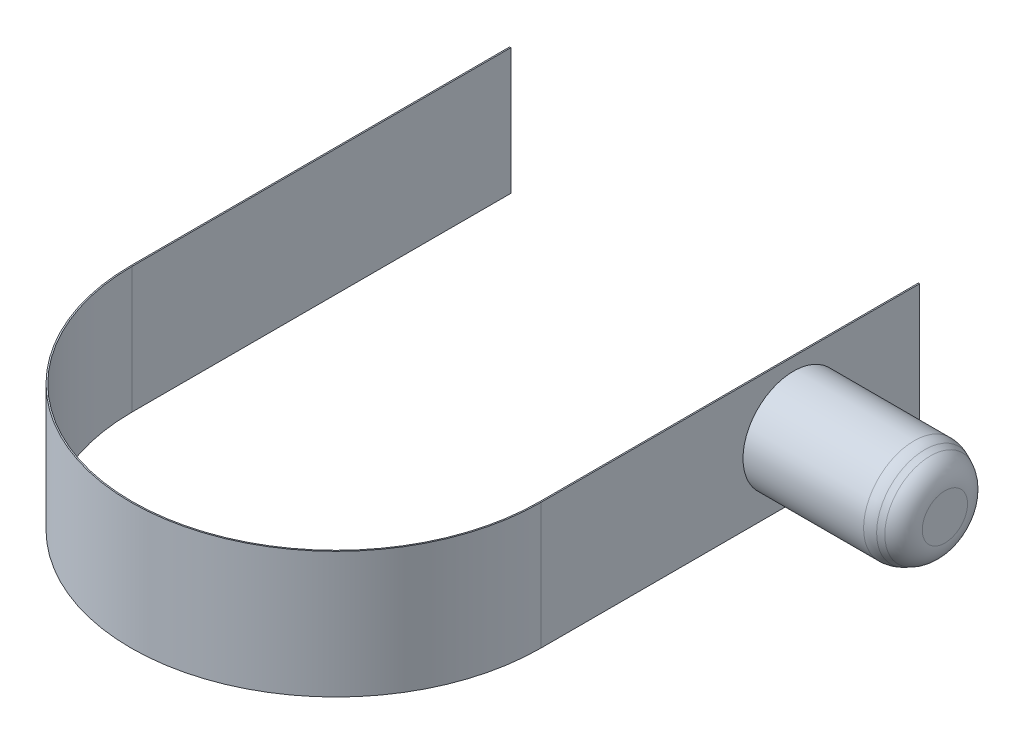
ISO-10303-21;
HEADER;
FILE_DESCRIPTION(('STEP AP214'),'2;1');
FILE_NAME('part.step','',(''),(''),'','','');
FILE_SCHEMA(('AUTOMOTIVE_DESIGN { 1 0 10303 214 1 1 1 1 }'));
ENDSEC;
DATA;
#1=APPLICATION_CONTEXT('core data for automotive mechanical design processes');
#2=APPLICATION_PROTOCOL_DEFINITION('international standard','automotive_design',2000,#1);
#3=PRODUCT_CONTEXT('',#1,'mechanical');
#4=PRODUCT('Part','Part','',(#3));
#5=PRODUCT_RELATED_PRODUCT_CATEGORY('part','',(#4));
#6=PRODUCT_DEFINITION_FORMATION('','',#4);
#7=PRODUCT_DEFINITION_CONTEXT('part definition',#1,'design');
#8=PRODUCT_DEFINITION('design','',#6,#7);
#9=PRODUCT_DEFINITION_SHAPE('','',#8);
#10=(LENGTH_UNIT() NAMED_UNIT(*) SI_UNIT(.MILLI.,.METRE.));
#11=(NAMED_UNIT(*) PLANE_ANGLE_UNIT() SI_UNIT($,.RADIAN.));
#12=(NAMED_UNIT(*) SI_UNIT($,.STERADIAN.) SOLID_ANGLE_UNIT());
#13=UNCERTAINTY_MEASURE_WITH_UNIT(LENGTH_MEASURE(1.E-05),#10,'distance_accuracy_value','');
#14=(GEOMETRIC_REPRESENTATION_CONTEXT(3) GLOBAL_UNCERTAINTY_ASSIGNED_CONTEXT((#13)) GLOBAL_UNIT_ASSIGNED_CONTEXT((#10,
#11,#12)) REPRESENTATION_CONTEXT('',''));
#15=CARTESIAN_POINT('',(0.,0.,0.));
#16=DIRECTION('',(0.,0.,1.));
#17=DIRECTION('',(1.,0.,0.));
#18=AXIS2_PLACEMENT_3D('',#15,#16,#17);
#19=CARTESIAN_POINT('',(16.2480768092719,5.,0.));
#20=DIRECTION('',(-1.,0.,0.));
#21=DIRECTION('',(0.,0.,1.));
#22=AXIS2_PLACEMENT_3D('',#19,#20,#21);
#23=PLANE('',#22);
#24=CARTESIAN_POINT('',(16.2480768092719,0.,-20.));
#25=DIRECTION('',(-1.,0.,0.));
#26=DIRECTION('',(0.,0.,1.));
#27=AXIS2_PLACEMENT_3D('',#24,#25,#26);
#28=CIRCLE('',#27,4.);
#29=CARTESIAN_POINT('',(16.2480768092719,0.,-16.));
#30=VERTEX_POINT('',#29);
#31=EDGE_CURVE('E170',#30,#30,#28,.F.);
#32=ORIENTED_EDGE('',*,*,#31,.F.);
#33=EDGE_LOOP('',(#32));
#34=FACE_BOUND('',#33,.T.);
#35=DIRECTION('',(0.,0.,-1.));
#36=VECTOR('',#35,1.);
#37=CARTESIAN_POINT('',(16.2480768092719,-5.,0.));
#38=LINE('',#37,#36);
#39=CARTESIAN_POINT('',(16.2480768092719,-5.,0.));
#40=VERTEX_POINT('',#39);
#41=CARTESIAN_POINT('',(16.2480768092719,-5.,-30.));
#42=VERTEX_POINT('',#41);
#43=EDGE_CURVE('E141',#40,#42,#38,.T.);
#44=ORIENTED_EDGE('',*,*,#43,.T.);
#45=DIRECTION('',(0.,-1.,0.));
#46=VECTOR('',#45,1.);
#47=CARTESIAN_POINT('',(16.2480768092719,5.,-30.));
#48=LINE('',#47,#46);
#49=CARTESIAN_POINT('',(16.2480768092719,5.,-30.));
#50=VERTEX_POINT('',#49);
#51=EDGE_CURVE('E168',#50,#42,#48,.T.);
#52=ORIENTED_EDGE('',*,*,#51,.F.);
#53=DIRECTION('',(0.,0.,-1.));
#54=VECTOR('',#53,1.);
#55=CARTESIAN_POINT('',(16.2480768092719,5.,0.));
#56=LINE('',#55,#54);
#57=CARTESIAN_POINT('',(16.2480768092719,5.,0.));
#58=VERTEX_POINT('',#57);
#59=EDGE_CURVE('E100',#58,#50,#56,.T.);
#60=ORIENTED_EDGE('',*,*,#59,.F.);
#61=DIRECTION('',(0.,-1.,0.));
#62=VECTOR('',#61,1.);
#63=CARTESIAN_POINT('',(16.2480768092719,5.,0.));
#64=LINE('',#63,#62);
#65=EDGE_CURVE('E140',#58,#40,#64,.T.);
#66=ORIENTED_EDGE('',*,*,#65,.T.);
#67=EDGE_LOOP('',(#44,#52,#60,#66));
#68=FACE_BOUND('',#67,.T.);
#69=ADVANCED_FACE('F43',(#34,#68),#23,.F.);
#70=CARTESIAN_POINT('',(16.1480768092719,5.,-30.));
#71=DIRECTION('',(0.,0.,-1.));
#72=DIRECTION('',(-1.,0.,0.));
#73=AXIS2_PLACEMENT_3D('',#70,#71,#72);
#74=PLANE('',#73);
#75=DIRECTION('',(1.,0.,0.));
#76=VECTOR('',#75,1.);
#77=CARTESIAN_POINT('',(16.1480768092719,-5.,-30.));
#78=LINE('',#77,#76);
#79=CARTESIAN_POINT('',(16.1480768092719,-5.,-30.));
#80=VERTEX_POINT('',#79);
#81=EDGE_CURVE('E144',#80,#42,#78,.T.);
#82=ORIENTED_EDGE('',*,*,#81,.F.);
#83=DIRECTION('',(0.,-1.,0.));
#84=VECTOR('',#83,1.);
#85=CARTESIAN_POINT('',(16.1480768092719,5.,-30.));
#86=LINE('',#85,#84);
#87=CARTESIAN_POINT('',(16.1480768092719,5.,-30.));
#88=VERTEX_POINT('',#87);
#89=EDGE_CURVE('E166',#88,#80,#86,.T.);
#90=ORIENTED_EDGE('',*,*,#89,.F.);
#91=DIRECTION('',(1.,0.,0.));
#92=VECTOR('',#91,1.);
#93=CARTESIAN_POINT('',(16.1480768092719,5.,-30.));
#94=LINE('',#93,#92);
#95=EDGE_CURVE('E386',#88,#50,#94,.T.);
#96=ORIENTED_EDGE('',*,*,#95,.T.);
#97=ORIENTED_EDGE('',*,*,#51,.T.);
#98=EDGE_LOOP('',(#82,#90,#96,#97));
#99=FACE_BOUND('',#98,.T.);
#100=ADVANCED_FACE('F202',(#99),#74,.T.);
#101=CARTESIAN_POINT('',(16.1480768092719,5.,0.));
#102=DIRECTION('',(-1.,0.,0.));
#103=DIRECTION('',(0.,0.,1.));
#104=AXIS2_PLACEMENT_3D('',#101,#102,#103);
#105=PLANE('',#104);
#106=DIRECTION('',(0.,0.,-1.));
#107=VECTOR('',#106,1.);
#108=CARTESIAN_POINT('',(16.1480768092719,-5.,0.));
#109=LINE('',#108,#107);
#110=CARTESIAN_POINT('',(16.1480768092719,-5.,0.));
#111=VERTEX_POINT('',#110);
#112=EDGE_CURVE('E147',#111,#80,#109,.T.);
#113=ORIENTED_EDGE('',*,*,#112,.F.);
#114=DIRECTION('',(0.,-1.,0.));
#115=VECTOR('',#114,1.);
#116=CARTESIAN_POINT('',(16.1480768092719,5.,0.));
#117=LINE('',#116,#115);
#118=CARTESIAN_POINT('',(16.1480768092719,5.,0.));
#119=VERTEX_POINT('',#118);
#120=EDGE_CURVE('E164',#119,#111,#117,.T.);
#121=ORIENTED_EDGE('',*,*,#120,.F.);
#122=DIRECTION('',(0.,0.,-1.));
#123=VECTOR('',#122,1.);
#124=CARTESIAN_POINT('',(16.1480768092719,5.,0.));
#125=LINE('',#124,#123);
#126=EDGE_CURVE('E388',#119,#88,#125,.T.);
#127=ORIENTED_EDGE('',*,*,#126,.T.);
#128=ORIENTED_EDGE('',*,*,#89,.T.);
#129=EDGE_LOOP('',(#113,#121,#127,#128));
#130=FACE_BOUND('',#129,.T.);
#131=ADVANCED_FACE('F208',(#130),#105,.T.);
#132=CARTESIAN_POINT('',(0.,5.,0.));
#133=DIRECTION('',(0.,-1.,0.));
#134=DIRECTION('',(0.,0.,-1.));
#135=AXIS2_PLACEMENT_3D('',#132,#133,#134);
#136=CYLINDRICAL_SURFACE('',#135,16.1480768092719);
#137=CARTESIAN_POINT('',(0.,-5.,0.));
#138=DIRECTION('',(0.,1.,0.));
#139=DIRECTION('',(1.,0.,0.));
#140=AXIS2_PLACEMENT_3D('',#137,#138,#139);
#141=CIRCLE('',#140,16.1480768092719);
#142=CARTESIAN_POINT('',(-16.1480768092719,-5.,0.));
#143=VERTEX_POINT('',#142);
#144=EDGE_CURVE('E150',#143,#111,#141,.T.);
#145=ORIENTED_EDGE('',*,*,#144,.F.);
#146=DIRECTION('',(0.,-1.,0.));
#147=VECTOR('',#146,1.);
#148=CARTESIAN_POINT('',(-16.1480768092719,5.,0.));
#149=LINE('',#148,#147);
#150=CARTESIAN_POINT('',(-16.1480768092719,5.,0.));
#151=VERTEX_POINT('',#150);
#152=EDGE_CURVE('E161',#151,#143,#149,.T.);
#153=ORIENTED_EDGE('',*,*,#152,.F.);
#154=CARTESIAN_POINT('',(0.,5.,0.));
#155=DIRECTION('',(0.,1.,0.));
#156=DIRECTION('',(1.,0.,0.));
#157=AXIS2_PLACEMENT_3D('',#154,#155,#156);
#158=CIRCLE('',#157,16.1480768092719);
#159=EDGE_CURVE('E135',#151,#119,#158,.T.);
#160=ORIENTED_EDGE('',*,*,#159,.T.);
#161=ORIENTED_EDGE('',*,*,#120,.T.);
#162=EDGE_LOOP('',(#145,#153,#160,#161));
#163=FACE_BOUND('',#162,.T.);
#164=ADVANCED_FACE('F219',(#163),#136,.F.);
#165=CARTESIAN_POINT('',(-16.1480768092719,5.,0.));
#166=DIRECTION('',(1.,0.,0.));
#167=DIRECTION('',(0.,0.,-1.));
#168=AXIS2_PLACEMENT_3D('',#165,#166,#167);
#169=PLANE('',#168);
#170=DIRECTION('',(0.,0.,-1.));
#171=VECTOR('',#170,1.);
#172=CARTESIAN_POINT('',(-16.1480768092719,5.,0.));
#173=LINE('',#172,#171);
#174=CARTESIAN_POINT('',(-16.1480768092719,5.,-30.));
#175=VERTEX_POINT('',#174);
#176=EDGE_CURVE('E133',#175,#151,#173,.F.);
#177=ORIENTED_EDGE('',*,*,#176,.T.);
#178=ORIENTED_EDGE('',*,*,#152,.T.);
#179=DIRECTION('',(0.,0.,-1.));
#180=VECTOR('',#179,1.);
#181=CARTESIAN_POINT('',(-16.1480768092719,-5.,0.));
#182=LINE('',#181,#180);
#183=CARTESIAN_POINT('',(-16.1480768092719,-5.,-30.));
#184=VERTEX_POINT('',#183);
#185=EDGE_CURVE('E153',#184,#143,#182,.F.);
#186=ORIENTED_EDGE('',*,*,#185,.F.);
#187=DIRECTION('',(0.,-1.,0.));
#188=VECTOR('',#187,1.);
#189=CARTESIAN_POINT('',(-16.1480768092719,5.,-30.));
#190=LINE('',#189,#188);
#191=EDGE_CURVE('E124',#175,#184,#190,.T.);
#192=ORIENTED_EDGE('',*,*,#191,.F.);
#193=EDGE_LOOP('',(#177,#178,#186,#192));
#194=FACE_BOUND('',#193,.T.);
#195=ADVANCED_FACE('F223',(#194),#169,.T.);
#196=CARTESIAN_POINT('',(-16.2480768092719,5.,-30.));
#197=DIRECTION('',(0.,0.,-1.));
#198=DIRECTION('',(-1.,0.,0.));
#199=AXIS2_PLACEMENT_3D('',#196,#197,#198);
#200=PLANE('',#199);
#201=DIRECTION('',(1.,0.,0.));
#202=VECTOR('',#201,1.);
#203=CARTESIAN_POINT('',(-16.2480768092719,-5.,-30.));
#204=LINE('',#203,#202);
#205=CARTESIAN_POINT('',(-16.2480768092719,-5.,-30.));
#206=VERTEX_POINT('',#205);
#207=EDGE_CURVE('E123',#206,#184,#204,.T.);
#208=ORIENTED_EDGE('',*,*,#207,.F.);
#209=DIRECTION('',(0.,-1.,0.));
#210=VECTOR('',#209,1.);
#211=CARTESIAN_POINT('',(-16.2480768092719,5.,-30.));
#212=LINE('',#211,#210);
#213=CARTESIAN_POINT('',(-16.2480768092719,5.,-30.));
#214=VERTEX_POINT('',#213);
#215=EDGE_CURVE('E117',#214,#206,#212,.T.);
#216=ORIENTED_EDGE('',*,*,#215,.F.);
#217=DIRECTION('',(1.,0.,0.));
#218=VECTOR('',#217,1.);
#219=CARTESIAN_POINT('',(-16.2480768092719,5.,-30.));
#220=LINE('',#219,#218);
#221=EDGE_CURVE('E121',#214,#175,#220,.T.);
#222=ORIENTED_EDGE('',*,*,#221,.T.);
#223=ORIENTED_EDGE('',*,*,#191,.T.);
#224=EDGE_LOOP('',(#208,#216,#222,#223));
#225=FACE_BOUND('',#224,.T.);
#226=ADVANCED_FACE('F119',(#225),#200,.T.);
#227=CARTESIAN_POINT('',(-16.2480768092719,5.,0.));
#228=DIRECTION('',(1.,0.,0.));
#229=DIRECTION('',(0.,0.,-1.));
#230=AXIS2_PLACEMENT_3D('',#227,#228,#229);
#231=PLANE('',#230);
#232=DIRECTION('',(0.,0.,1.));
#233=VECTOR('',#232,1.);
#234=CARTESIAN_POINT('',(-16.2480768092719,-5.,0.));
#235=LINE('',#234,#233);
#236=CARTESIAN_POINT('',(-16.2480768092719,-5.,0.));
#237=VERTEX_POINT('',#236);
#238=EDGE_CURVE('E88',#206,#237,#235,.T.);
#239=ORIENTED_EDGE('',*,*,#238,.T.);
#240=DIRECTION('',(0.,-1.,0.));
#241=VECTOR('',#240,1.);
#242=CARTESIAN_POINT('',(-16.2480768092719,5.,0.));
#243=LINE('',#242,#241);
#244=CARTESIAN_POINT('',(-16.2480768092719,5.,0.));
#245=VERTEX_POINT('',#244);
#246=EDGE_CURVE('E125',#245,#237,#243,.T.);
#247=ORIENTED_EDGE('',*,*,#246,.F.);
#248=DIRECTION('',(0.,0.,1.));
#249=VECTOR('',#248,1.);
#250=CARTESIAN_POINT('',(-16.2480768092719,5.,0.));
#251=LINE('',#250,#249);
#252=EDGE_CURVE('E127',#214,#245,#251,.T.);
#253=ORIENTED_EDGE('',*,*,#252,.F.);
#254=ORIENTED_EDGE('',*,*,#215,.T.);
#255=EDGE_LOOP('',(#239,#247,#253,#254));
#256=FACE_BOUND('',#255,.T.);
#257=ADVANCED_FACE('F128',(#256),#231,.F.);
#258=CARTESIAN_POINT('',(0.,5.,0.));
#259=DIRECTION('',(0.,-1.,0.));
#260=DIRECTION('',(0.,0.,-1.));
#261=AXIS2_PLACEMENT_3D('',#258,#259,#260);
#262=CYLINDRICAL_SURFACE('',#261,16.2480768092719);
#263=CARTESIAN_POINT('',(0.,-5.,0.));
#264=DIRECTION('',(0.,1.,0.));
#265=DIRECTION('',(0.,0.,1.));
#266=AXIS2_PLACEMENT_3D('',#263,#264,#265);
#267=CIRCLE('',#266,16.2480768092719);
#268=EDGE_CURVE('E94',#237,#40,#267,.T.);
#269=ORIENTED_EDGE('',*,*,#268,.T.);
#270=ORIENTED_EDGE('',*,*,#65,.F.);
#271=CARTESIAN_POINT('',(0.,5.,0.));
#272=DIRECTION('',(0.,1.,0.));
#273=DIRECTION('',(0.,0.,1.));
#274=AXIS2_PLACEMENT_3D('',#271,#272,#273);
#275=CIRCLE('',#274,16.2480768092719);
#276=EDGE_CURVE('E60',#245,#58,#275,.T.);
#277=ORIENTED_EDGE('',*,*,#276,.F.);
#278=ORIENTED_EDGE('',*,*,#246,.T.);
#279=EDGE_LOOP('',(#269,#270,#277,#278));
#280=FACE_BOUND('',#279,.T.);
#281=ADVANCED_FACE('F232',(#280),#262,.T.);
#282=CARTESIAN_POINT('',(0.,5.,0.));
#283=DIRECTION('',(0.,1.,0.));
#284=DIRECTION('',(1.,0.,0.));
#285=AXIS2_PLACEMENT_3D('',#282,#283,#284);
#286=PLANE('',#285);
#287=ORIENTED_EDGE('',*,*,#159,.F.);
#288=ORIENTED_EDGE('',*,*,#176,.F.);
#289=ORIENTED_EDGE('',*,*,#221,.F.);
#290=ORIENTED_EDGE('',*,*,#252,.T.);
#291=ORIENTED_EDGE('',*,*,#276,.T.);
#292=ORIENTED_EDGE('',*,*,#59,.T.);
#293=ORIENTED_EDGE('',*,*,#95,.F.);
#294=ORIENTED_EDGE('',*,*,#126,.F.);
#295=EDGE_LOOP('',(#287,#288,#289,#290,#291,#292,#293,#294));
#296=FACE_BOUND('',#295,.T.);
#297=ADVANCED_FACE('F132',(#296),#286,.T.);
#298=CARTESIAN_POINT('',(0.,-5.,0.));
#299=DIRECTION('',(0.,1.,0.));
#300=DIRECTION('',(1.,0.,0.));
#301=AXIS2_PLACEMENT_3D('',#298,#299,#300);
#302=PLANE('',#301);
#303=ORIENTED_EDGE('',*,*,#268,.F.);
#304=ORIENTED_EDGE('',*,*,#238,.F.);
#305=ORIENTED_EDGE('',*,*,#207,.T.);
#306=ORIENTED_EDGE('',*,*,#185,.T.);
#307=ORIENTED_EDGE('',*,*,#144,.T.);
#308=ORIENTED_EDGE('',*,*,#112,.T.);
#309=ORIENTED_EDGE('',*,*,#81,.T.);
#310=ORIENTED_EDGE('',*,*,#43,.F.);
#311=EDGE_LOOP('',(#303,#304,#305,#306,#307,#308,#309,#310));
#312=FACE_BOUND('',#311,.T.);
#313=ADVANCED_FACE('F198',(#312),#302,.F.);
#314=CARTESIAN_POINT('',(28.2480768092719,0.,-20.));
#315=DIRECTION('',(-1.,0.,0.));
#316=DIRECTION('',(0.,0.,1.));
#317=AXIS2_PLACEMENT_3D('',#314,#315,#316);
#318=CYLINDRICAL_SURFACE('',#317,4.);
#319=CARTESIAN_POINT('',(25.804687483986,0.,-20.));
#320=DIRECTION('',(1.,0.,0.));
#321=DIRECTION('',(0.,0.,-1.));
#322=AXIS2_PLACEMENT_3D('',#319,#320,#321);
#323=CIRCLE('',#322,4.);
#324=CARTESIAN_POINT('',(25.804687483986,0.,-24.));
#325=VERTEX_POINT('',#324);
#326=EDGE_CURVE('E11',#325,#325,#323,.F.);
#327=ORIENTED_EDGE('',*,*,#326,.T.);
#328=EDGE_LOOP('',(#327));
#329=FACE_BOUND('',#328,.T.);
#330=ORIENTED_EDGE('',*,*,#31,.T.);
#331=EDGE_LOOP('',(#330));
#332=FACE_BOUND('',#331,.T.);
#333=ADVANCED_FACE('F191',(#329,#332),#318,.T.);
#334=CARTESIAN_POINT('',(28.2480768092719,0.,-20.));
#335=DIRECTION('',(1.,0.,0.));
#336=DIRECTION('',(0.,0.,-1.));
#337=AXIS2_PLACEMENT_3D('',#334,#335,#336);
#338=PLANE('',#337);
#339=CARTESIAN_POINT('',(28.2480768092719,0.,-20.));
#340=DIRECTION('',(1.,0.,0.));
#341=DIRECTION('',(0.,0.,-1.));
#342=AXIS2_PLACEMENT_3D('',#339,#340,#341);
#343=CIRCLE('',#342,1.79324416207502);
#344=CARTESIAN_POINT('',(28.2480768092719,0.,-21.793244162075));
#345=VERTEX_POINT('',#344);
#346=EDGE_CURVE('E173',#345,#345,#343,.T.);
#347=ORIENTED_EDGE('',*,*,#346,.T.);
#348=EDGE_LOOP('',(#347));
#349=FACE_BOUND('',#348,.T.);
#350=ADVANCED_FACE('F189',(#349),#338,.T.);
#351=CARTESIAN_POINT('',(28.2480768092719,0.,-20.));
#352=DIRECTION('',(-1.,0.,0.));
#353=DIRECTION('',(0.,0.,1.));
#354=AXIS2_PLACEMENT_3D('',#351,#352,#353);
#355=CONICAL_SURFACE('',#354,3.06738468369001,0.436332312998579);
#356=CARTESIAN_POINT('',(27.0933133327533,0.,-20.));
#357=DIRECTION('',(1.,0.,0.));
#358=DIRECTION('',(0.,0.,-1.));
#359=AXIS2_PLACEMENT_3D('',#356,#357,#358);
#360=CIRCLE('',#359,3.60585973614832);
#361=CARTESIAN_POINT('',(27.0933133327533,0.,-23.6058597361483));
#362=VERTEX_POINT('',#361);
#363=EDGE_CURVE('E52',#362,#362,#360,.F.);
#364=ORIENTED_EDGE('',*,*,#363,.T.);
#365=EDGE_LOOP('',(#364));
#366=FACE_BOUND('',#365,.T.);
#367=CARTESIAN_POINT('',(26.6499240074674,0.,-20.));
#368=DIRECTION('',(-1.,0.,0.));
#369=DIRECTION('',(0.,0.,1.));
#370=AXIS2_PLACEMENT_3D('',#367,#368,#369);
#371=CIRCLE('',#370,3.8126155740733);
#372=CARTESIAN_POINT('',(26.6499240074674,0.,-16.1873844259267));
#373=VERTEX_POINT('',#372);
#374=EDGE_CURVE('E176',#373,#373,#371,.F.);
#375=ORIENTED_EDGE('',*,*,#374,.T.);
#376=EDGE_LOOP('',(#375));
#377=FACE_BOUND('',#376,.T.);
#378=ADVANCED_FACE('F181',(#366,#377),#355,.T.);
#379=CARTESIAN_POINT('',(26.2480768092719,0.,-20.));
#380=DIRECTION('',(1.,0.,0.));
#381=DIRECTION('',(0.,0.,-1.));
#382=AXIS2_PLACEMENT_3D('',#379,#380,#381);
#383=DEGENERATE_TOROIDAL_SURFACE('',#382,1.79324416207502,2.,.T.);
#384=ORIENTED_EDGE('',*,*,#363,.F.);
#385=EDGE_LOOP('',(#384));
#386=FACE_BOUND('',#385,.T.);
#387=ORIENTED_EDGE('',*,*,#346,.F.);
#388=EDGE_LOOP('',(#387));
#389=FACE_BOUND('',#388,.T.);
#390=ADVANCED_FACE('F184',(#386,#389),#383,.T.);
#391=CARTESIAN_POINT('',(25.804687483986,0.,-20.));
#392=DIRECTION('',(1.,0.,0.));
#393=DIRECTION('',(0.,0.,-1.));
#394=AXIS2_PLACEMENT_3D('',#391,#392,#393);
#395=DEGENERATE_TOROIDAL_SURFACE('',#394,2.,2.,.T.);
#396=ORIENTED_EDGE('',*,*,#374,.F.);
#397=EDGE_LOOP('',(#396));
#398=FACE_BOUND('',#397,.T.);
#399=ORIENTED_EDGE('',*,*,#326,.F.);
#400=EDGE_LOOP('',(#399));
#401=FACE_BOUND('',#400,.T.);
#402=ADVANCED_FACE('F45',(#398,#401),#395,.T.);
#403=CLOSED_SHELL('',(#69,#100,#131,#164,#195,#226,#257,#281,#297,#313,#333,#350,#378,#390,#402));
#404=MANIFOLD_SOLID_BREP('B2',#403);
#405=ADVANCED_BREP_SHAPE_REPRESENTATION('',(#18,#404),#14);
#406=SHAPE_DEFINITION_REPRESENTATION(#9,#405);
ENDSEC;
END-ISO-10303-21;
